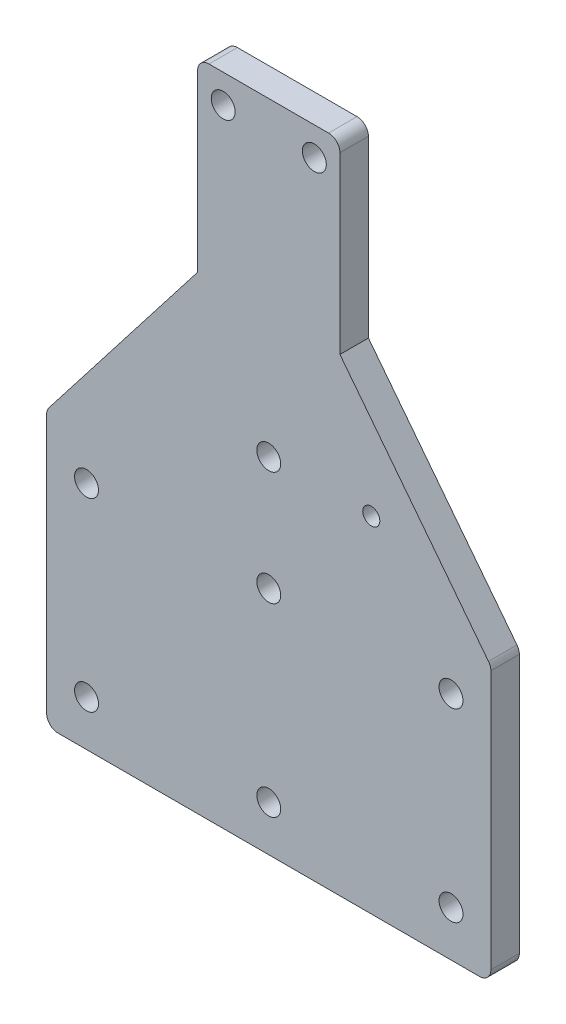
ISO-10303-21;
HEADER;
FILE_DESCRIPTION(('STEP AP214'),'2;1');
FILE_NAME('part.step','',(''),(''),'','','');
FILE_SCHEMA(('AUTOMOTIVE_DESIGN { 1 0 10303 214 1 1 1 1 }'));
ENDSEC;
DATA;
#1=APPLICATION_CONTEXT('core data for automotive mechanical design processes');
#2=APPLICATION_PROTOCOL_DEFINITION('international standard','automotive_design',2000,#1);
#3=PRODUCT_CONTEXT('',#1,'mechanical');
#4=PRODUCT('Part','Part','',(#3));
#5=PRODUCT_RELATED_PRODUCT_CATEGORY('part','',(#4));
#6=PRODUCT_DEFINITION_FORMATION('','',#4);
#7=PRODUCT_DEFINITION_CONTEXT('part definition',#1,'design');
#8=PRODUCT_DEFINITION('design','',#6,#7);
#9=PRODUCT_DEFINITION_SHAPE('','',#8);
#10=(LENGTH_UNIT() NAMED_UNIT(*) SI_UNIT(.MILLI.,.METRE.));
#11=(NAMED_UNIT(*) PLANE_ANGLE_UNIT() SI_UNIT($,.RADIAN.));
#12=(NAMED_UNIT(*) SI_UNIT($,.STERADIAN.) SOLID_ANGLE_UNIT());
#13=UNCERTAINTY_MEASURE_WITH_UNIT(LENGTH_MEASURE(1.E-05),#10,'distance_accuracy_value','');
#14=(GEOMETRIC_REPRESENTATION_CONTEXT(3) GLOBAL_UNCERTAINTY_ASSIGNED_CONTEXT((#13)) GLOBAL_UNIT_ASSIGNED_CONTEXT((#10,
#11,#12)) REPRESENTATION_CONTEXT('',''));
#15=CARTESIAN_POINT('',(0.,0.,0.));
#16=DIRECTION('',(0.,0.,1.));
#17=DIRECTION('',(1.,0.,0.));
#18=AXIS2_PLACEMENT_3D('',#15,#16,#17);
#19=CARTESIAN_POINT('',(-39.,100.232788631687,5.));
#20=DIRECTION('',(1.,0.,0.));
#21=DIRECTION('',(0.,1.,0.));
#22=AXIS2_PLACEMENT_3D('',#19,#20,#21);
#23=PLANE('',#22);
#24=DIRECTION('',(0.,-1.,0.));
#25=VECTOR('',#24,1.);
#26=CARTESIAN_POINT('',(-39.,100.232788631687,0.));
#27=LINE('',#26,#25);
#28=CARTESIAN_POINT('',(-39.,99.5481536847553,0.));
#29=VERTEX_POINT('',#28);
#30=CARTESIAN_POINT('',(-39.,54.0749999999989,0.));
#31=VERTEX_POINT('',#30);
#32=EDGE_CURVE('E180',#29,#31,#27,.T.);
#33=ORIENTED_EDGE('',*,*,#32,.T.);
#34=DIRECTION('',(0.,0.,-1.));
#35=VECTOR('',#34,1.);
#36=CARTESIAN_POINT('',(-39.,54.0749999999989,5.));
#37=LINE('',#36,#35);
#38=CARTESIAN_POINT('',(-39.,54.0749999999989,5.));
#39=VERTEX_POINT('',#38);
#40=EDGE_CURVE('E237',#31,#39,#37,.F.);
#41=ORIENTED_EDGE('',*,*,#40,.T.);
#42=DIRECTION('',(0.,-1.,0.));
#43=VECTOR('',#42,1.);
#44=CARTESIAN_POINT('',(-39.,100.232788631687,5.));
#45=LINE('',#44,#43);
#46=CARTESIAN_POINT('',(-39.,99.5481536847553,5.));
#47=VERTEX_POINT('',#46);
#48=EDGE_CURVE('E200',#47,#39,#45,.T.);
#49=ORIENTED_EDGE('',*,*,#48,.F.);
#50=DIRECTION('',(0.,0.,-1.));
#51=VECTOR('',#50,1.);
#52=CARTESIAN_POINT('',(-39.,99.5481536847553,5.));
#53=LINE('',#52,#51);
#54=EDGE_CURVE('E234',#47,#29,#53,.T.);
#55=ORIENTED_EDGE('',*,*,#54,.T.);
#56=EDGE_LOOP('',(#33,#41,#49,#55));
#57=FACE_BOUND('',#56,.T.);
#58=ADVANCED_FACE('F41',(#57),#23,.F.);
#59=CARTESIAN_POINT('',(27.0128557375144,52.0749999999988,5.));
#60=DIRECTION('',(0.,1.,0.));
#61=DIRECTION('',(-1.,0.,0.));
#62=AXIS2_PLACEMENT_3D('',#59,#60,#61);
#63=PLANE('',#62);
#64=DIRECTION('',(1.,0.,0.));
#65=VECTOR('',#64,1.);
#66=CARTESIAN_POINT('',(27.0128557375144,52.0749999999988,0.));
#67=LINE('',#66,#65);
#68=CARTESIAN_POINT('',(-37.,52.0749999999989,0.));
#69=VERTEX_POINT('',#68);
#70=CARTESIAN_POINT('',(37.,52.0749999999988,0.));
#71=VERTEX_POINT('',#70);
#72=EDGE_CURVE('E183',#69,#71,#67,.T.);
#73=ORIENTED_EDGE('',*,*,#72,.T.);
#74=DIRECTION('',(0.,0.,-1.));
#75=VECTOR('',#74,1.);
#76=CARTESIAN_POINT('',(37.,52.0749999999988,5.));
#77=LINE('',#76,#75);
#78=CARTESIAN_POINT('',(37.,52.0749999999988,5.));
#79=VERTEX_POINT('',#78);
#80=EDGE_CURVE('E222',#71,#79,#77,.F.);
#81=ORIENTED_EDGE('',*,*,#80,.T.);
#82=DIRECTION('',(1.,0.,0.));
#83=VECTOR('',#82,1.);
#84=CARTESIAN_POINT('',(-39.,52.0749999999988,5.));
#85=LINE('',#84,#83);
#86=CARTESIAN_POINT('',(-37.,52.0749999999988,5.));
#87=VERTEX_POINT('',#86);
#88=EDGE_CURVE('E275',#87,#79,#85,.T.);
#89=ORIENTED_EDGE('',*,*,#88,.F.);
#90=DIRECTION('',(0.,0.,-1.));
#91=VECTOR('',#90,1.);
#92=CARTESIAN_POINT('',(-37.,52.0749999999989,5.));
#93=LINE('',#92,#91);
#94=EDGE_CURVE('E219',#87,#69,#93,.T.);
#95=ORIENTED_EDGE('',*,*,#94,.T.);
#96=EDGE_LOOP('',(#73,#81,#89,#95));
#97=FACE_BOUND('',#96,.T.);
#98=ADVANCED_FACE('F294',(#97),#63,.F.);
#99=CARTESIAN_POINT('',(39.,100.232788631687,5.));
#100=DIRECTION('',(-1.,0.,0.));
#101=DIRECTION('',(0.,-1.,0.));
#102=AXIS2_PLACEMENT_3D('',#99,#100,#101);
#103=PLANE('',#102);
#104=DIRECTION('',(0.,1.,0.));
#105=VECTOR('',#104,1.);
#106=CARTESIAN_POINT('',(39.,100.232788631687,5.));
#107=LINE('',#106,#105);
#108=CARTESIAN_POINT('',(39.,54.0749999999988,5.));
#109=VERTEX_POINT('',#108);
#110=CARTESIAN_POINT('',(39.,99.5481536847553,5.));
#111=VERTEX_POINT('',#110);
#112=EDGE_CURVE('E156',#109,#111,#107,.T.);
#113=ORIENTED_EDGE('',*,*,#112,.F.);
#114=DIRECTION('',(0.,0.,-1.));
#115=VECTOR('',#114,1.);
#116=CARTESIAN_POINT('',(39.,54.0749999999988,5.));
#117=LINE('',#116,#115);
#118=CARTESIAN_POINT('',(39.,54.0749999999988,0.));
#119=VERTEX_POINT('',#118);
#120=EDGE_CURVE('E204',#109,#119,#117,.T.);
#121=ORIENTED_EDGE('',*,*,#120,.T.);
#122=DIRECTION('',(0.,1.,0.));
#123=VECTOR('',#122,1.);
#124=CARTESIAN_POINT('',(39.,100.232788631687,0.));
#125=LINE('',#124,#123);
#126=CARTESIAN_POINT('',(39.,99.5481536847553,0.));
#127=VERTEX_POINT('',#126);
#128=EDGE_CURVE('E187',#119,#127,#125,.T.);
#129=ORIENTED_EDGE('',*,*,#128,.T.);
#130=DIRECTION('',(0.,0.,-1.));
#131=VECTOR('',#130,1.);
#132=CARTESIAN_POINT('',(39.,99.5481536847553,5.));
#133=LINE('',#132,#131);
#134=EDGE_CURVE('E166',#127,#111,#133,.F.);
#135=ORIENTED_EDGE('',*,*,#134,.T.);
#136=EDGE_LOOP('',(#113,#121,#129,#135));
#137=FACE_BOUND('',#136,.T.);
#138=ADVANCED_FACE('F299',(#137),#103,.F.);
#139=CARTESIAN_POINT('',(12.4999999999999,134.403841263267,5.));
#140=DIRECTION('',(-0.790219801194744,-0.612823519293883,0.));
#141=DIRECTION('',(0.612823519293883,-0.790219801194744,0.));
#142=AXIS2_PLACEMENT_3D('',#139,#140,#141);
#143=PLANE('',#142);
#144=DIRECTION('',(-0.612823519293883,0.790219801194744,0.));
#145=VECTOR('',#144,1.);
#146=CARTESIAN_POINT('',(12.4999999999999,134.403841263267,5.));
#147=LINE('',#146,#145);
#148=CARTESIAN_POINT('',(38.5804396023895,100.773800723343,5.));
#149=VERTEX_POINT('',#148);
#150=CARTESIAN_POINT('',(12.4999999999999,134.403841263267,5.));
#151=VERTEX_POINT('',#150);
#152=EDGE_CURVE('E143',#149,#151,#147,.T.);
#153=ORIENTED_EDGE('',*,*,#152,.F.);
#154=DIRECTION('',(0.,0.,-1.));
#155=VECTOR('',#154,1.);
#156=CARTESIAN_POINT('',(38.5804396023895,100.773800723343,5.));
#157=LINE('',#156,#155);
#158=CARTESIAN_POINT('',(38.5804396023895,100.773800723343,0.));
#159=VERTEX_POINT('',#158);
#160=EDGE_CURVE('E240',#149,#159,#157,.T.);
#161=ORIENTED_EDGE('',*,*,#160,.T.);
#162=DIRECTION('',(-0.612823519293883,0.790219801194744,0.));
#163=VECTOR('',#162,1.);
#164=CARTESIAN_POINT('',(12.4999999999999,134.403841263267,0.));
#165=LINE('',#164,#163);
#166=CARTESIAN_POINT('',(12.4999999999999,134.403841263267,0.));
#167=VERTEX_POINT('',#166);
#168=EDGE_CURVE('E162',#159,#167,#165,.T.);
#169=ORIENTED_EDGE('',*,*,#168,.T.);
#170=DIRECTION('',(0.,0.,-1.));
#171=VECTOR('',#170,1.);
#172=CARTESIAN_POINT('',(12.4999999999999,134.403841263267,5.));
#173=LINE('',#172,#171);
#174=EDGE_CURVE('E159',#151,#167,#173,.T.);
#175=ORIENTED_EDGE('',*,*,#174,.F.);
#176=EDGE_LOOP('',(#153,#161,#169,#175));
#177=FACE_BOUND('',#176,.T.);
#178=ADVANCED_FACE('F160',(#177),#143,.F.);
#179=CARTESIAN_POINT('',(12.4999999999999,167.074999999999,5.));
#180=DIRECTION('',(-1.,0.,0.));
#181=DIRECTION('',(0.,0.,1.));
#182=AXIS2_PLACEMENT_3D('',#179,#180,#181);
#183=PLANE('',#182);
#184=DIRECTION('',(0.,1.,0.));
#185=VECTOR('',#184,1.);
#186=CARTESIAN_POINT('',(12.4999999999999,167.074999999999,0.));
#187=LINE('',#186,#185);
#188=CARTESIAN_POINT('',(12.4999999999999,165.074999999999,0.));
#189=VERTEX_POINT('',#188);
#190=EDGE_CURVE('E191',#167,#189,#187,.T.);
#191=ORIENTED_EDGE('',*,*,#190,.T.);
#192=DIRECTION('',(0.,0.,-1.));
#193=VECTOR('',#192,1.);
#194=CARTESIAN_POINT('',(12.4999999999999,165.074999999999,5.));
#195=LINE('',#194,#193);
#196=CARTESIAN_POINT('',(12.4999999999999,165.074999999999,5.));
#197=VERTEX_POINT('',#196);
#198=EDGE_CURVE('E11',#189,#197,#195,.F.);
#199=ORIENTED_EDGE('',*,*,#198,.T.);
#200=DIRECTION('',(0.,1.,0.));
#201=VECTOR('',#200,1.);
#202=CARTESIAN_POINT('',(12.4999999999999,167.074999999999,5.));
#203=LINE('',#202,#201);
#204=EDGE_CURVE('E148',#151,#197,#203,.T.);
#205=ORIENTED_EDGE('',*,*,#204,.F.);
#206=ORIENTED_EDGE('',*,*,#174,.T.);
#207=EDGE_LOOP('',(#191,#199,#205,#206));
#208=FACE_BOUND('',#207,.T.);
#209=ADVANCED_FACE('F169',(#208),#183,.F.);
#210=CARTESIAN_POINT('',(-12.4999999999999,167.074999999999,5.));
#211=DIRECTION('',(0.,-1.,0.));
#212=DIRECTION('',(0.,0.,-1.));
#213=AXIS2_PLACEMENT_3D('',#210,#211,#212);
#214=PLANE('',#213);
#215=DIRECTION('',(-1.,0.,0.));
#216=VECTOR('',#215,1.);
#217=CARTESIAN_POINT('',(-12.4999999999999,167.074999999999,0.));
#218=LINE('',#217,#216);
#219=CARTESIAN_POINT('',(10.4999999999999,167.074999999999,0.));
#220=VERTEX_POINT('',#219);
#221=CARTESIAN_POINT('',(-10.4999999999999,167.074999999999,0.));
#222=VERTEX_POINT('',#221);
#223=EDGE_CURVE('E193',#220,#222,#218,.T.);
#224=ORIENTED_EDGE('',*,*,#223,.T.);
#225=DIRECTION('',(0.,0.,-1.));
#226=VECTOR('',#225,1.);
#227=CARTESIAN_POINT('',(-10.4999999999999,167.074999999999,5.));
#228=LINE('',#227,#226);
#229=CARTESIAN_POINT('',(-10.4999999999999,167.074999999999,5.));
#230=VERTEX_POINT('',#229);
#231=EDGE_CURVE('E49',#222,#230,#228,.F.);
#232=ORIENTED_EDGE('',*,*,#231,.T.);
#233=DIRECTION('',(-1.,0.,0.));
#234=VECTOR('',#233,1.);
#235=CARTESIAN_POINT('',(-12.4999999999999,167.074999999999,5.));
#236=LINE('',#235,#234);
#237=CARTESIAN_POINT('',(10.4999999999999,167.074999999999,5.));
#238=VERTEX_POINT('',#237);
#239=EDGE_CURVE('E171',#238,#230,#236,.T.);
#240=ORIENTED_EDGE('',*,*,#239,.F.);
#241=DIRECTION('',(0.,0.,-1.));
#242=VECTOR('',#241,1.);
#243=CARTESIAN_POINT('',(10.4999999999999,167.074999999999,5.));
#244=LINE('',#243,#242);
#245=EDGE_CURVE('E245',#238,#220,#244,.T.);
#246=ORIENTED_EDGE('',*,*,#245,.T.);
#247=EDGE_LOOP('',(#224,#232,#240,#246));
#248=FACE_BOUND('',#247,.T.);
#249=ADVANCED_FACE('F250',(#248),#214,.F.);
#250=CARTESIAN_POINT('',(-12.4999999999999,134.403841263267,5.));
#251=DIRECTION('',(1.,0.,0.));
#252=DIRECTION('',(0.,0.,-1.));
#253=AXIS2_PLACEMENT_3D('',#250,#251,#252);
#254=PLANE('',#253);
#255=DIRECTION('',(0.,-1.,0.));
#256=VECTOR('',#255,1.);
#257=CARTESIAN_POINT('',(-12.4999999999999,134.403841263267,5.));
#258=LINE('',#257,#256);
#259=CARTESIAN_POINT('',(-12.4999999999999,165.074999999999,5.));
#260=VERTEX_POINT('',#259);
#261=CARTESIAN_POINT('',(-12.4999999999999,134.403841263267,5.));
#262=VERTEX_POINT('',#261);
#263=EDGE_CURVE('E173',#260,#262,#258,.T.);
#264=ORIENTED_EDGE('',*,*,#263,.F.);
#265=DIRECTION('',(0.,0.,-1.));
#266=VECTOR('',#265,1.);
#267=CARTESIAN_POINT('',(-12.4999999999999,165.074999999999,5.));
#268=LINE('',#267,#266);
#269=CARTESIAN_POINT('',(-12.4999999999999,165.074999999999,0.));
#270=VERTEX_POINT('',#269);
#271=EDGE_CURVE('E242',#260,#270,#268,.T.);
#272=ORIENTED_EDGE('',*,*,#271,.T.);
#273=DIRECTION('',(0.,-1.,0.));
#274=VECTOR('',#273,1.);
#275=CARTESIAN_POINT('',(-12.4999999999999,134.403841263267,0.));
#276=LINE('',#275,#274);
#277=CARTESIAN_POINT('',(-12.4999999999999,134.403841263267,0.));
#278=VERTEX_POINT('',#277);
#279=EDGE_CURVE('E196',#270,#278,#276,.T.);
#280=ORIENTED_EDGE('',*,*,#279,.T.);
#281=DIRECTION('',(0.,0.,-1.));
#282=VECTOR('',#281,1.);
#283=CARTESIAN_POINT('',(-12.4999999999999,134.403841263267,5.));
#284=LINE('',#283,#282);
#285=EDGE_CURVE('E167',#262,#278,#284,.T.);
#286=ORIENTED_EDGE('',*,*,#285,.F.);
#287=EDGE_LOOP('',(#264,#272,#280,#286));
#288=FACE_BOUND('',#287,.T.);
#289=ADVANCED_FACE('F258',(#288),#254,.F.);
#290=CARTESIAN_POINT('',(-39.,100.232788631687,5.));
#291=DIRECTION('',(0.790219801194744,-0.612823519293883,0.));
#292=DIRECTION('',(0.612823519293883,0.790219801194744,0.));
#293=AXIS2_PLACEMENT_3D('',#290,#291,#292);
#294=PLANE('',#293);
#295=DIRECTION('',(-0.612823519293883,-0.790219801194744,0.));
#296=VECTOR('',#295,1.);
#297=CARTESIAN_POINT('',(-39.,100.232788631687,0.));
#298=LINE('',#297,#296);
#299=CARTESIAN_POINT('',(-38.5804396023895,100.773800723343,0.));
#300=VERTEX_POINT('',#299);
#301=EDGE_CURVE('E198',#278,#300,#298,.T.);
#302=ORIENTED_EDGE('',*,*,#301,.T.);
#303=DIRECTION('',(0.,0.,-1.));
#304=VECTOR('',#303,1.);
#305=CARTESIAN_POINT('',(-38.5804396023895,100.773800723343,5.));
#306=LINE('',#305,#304);
#307=CARTESIAN_POINT('',(-38.5804396023895,100.773800723343,5.));
#308=VERTEX_POINT('',#307);
#309=EDGE_CURVE('E56',#300,#308,#306,.F.);
#310=ORIENTED_EDGE('',*,*,#309,.T.);
#311=DIRECTION('',(-0.612823519293883,-0.790219801194744,0.));
#312=VECTOR('',#311,1.);
#313=CARTESIAN_POINT('',(-39.,100.232788631687,5.));
#314=LINE('',#313,#312);
#315=EDGE_CURVE('E178',#262,#308,#314,.T.);
#316=ORIENTED_EDGE('',*,*,#315,.F.);
#317=ORIENTED_EDGE('',*,*,#285,.T.);
#318=EDGE_LOOP('',(#302,#310,#316,#317));
#319=FACE_BOUND('',#318,.T.);
#320=ADVANCED_FACE('F265',(#319),#294,.F.);
#321=CARTESIAN_POINT('',(0.,0.,5.));
#322=DIRECTION('',(0.,0.,1.));
#323=DIRECTION('',(1.,0.,0.));
#324=AXIS2_PLACEMENT_3D('',#321,#322,#323);
#325=PLANE('',#324);
#326=CARTESIAN_POINT('',(32.,60.0749999999988,5.));
#327=DIRECTION('',(0.,0.,-1.));
#328=DIRECTION('',(-1.,0.,0.));
#329=AXIS2_PLACEMENT_3D('',#326,#327,#328);
#330=CIRCLE('',#329,2.1);
#331=CARTESIAN_POINT('',(29.9,60.0749999999988,5.));
#332=VERTEX_POINT('',#331);
#333=EDGE_CURVE('E585',#332,#332,#330,.T.);
#334=ORIENTED_EDGE('',*,*,#333,.T.);
#335=EDGE_LOOP('',(#334));
#336=FACE_BOUND('',#335,.T.);
#337=CARTESIAN_POINT('',(-32.,60.0749999999988,5.));
#338=DIRECTION('',(0.,0.,-1.));
#339=DIRECTION('',(-1.,0.,0.));
#340=AXIS2_PLACEMENT_3D('',#337,#338,#339);
#341=CIRCLE('',#340,2.1);
#342=CARTESIAN_POINT('',(-34.1,60.0749999999988,5.));
#343=VERTEX_POINT('',#342);
#344=EDGE_CURVE('E589',#343,#343,#341,.T.);
#345=ORIENTED_EDGE('',*,*,#344,.T.);
#346=EDGE_LOOP('',(#345));
#347=FACE_BOUND('',#346,.T.);
#348=CARTESIAN_POINT('',(0.,60.0749999999988,5.));
#349=DIRECTION('',(0.,0.,-1.));
#350=DIRECTION('',(-1.,0.,0.));
#351=AXIS2_PLACEMENT_3D('',#348,#349,#350);
#352=CIRCLE('',#351,2.1);
#353=CARTESIAN_POINT('',(-2.1,60.0749999999988,5.));
#354=VERTEX_POINT('',#353);
#355=EDGE_CURVE('E593',#354,#354,#352,.T.);
#356=ORIENTED_EDGE('',*,*,#355,.T.);
#357=EDGE_LOOP('',(#356));
#358=FACE_BOUND('',#357,.T.);
#359=CARTESIAN_POINT('',(0.,112.574999999999,5.));
#360=DIRECTION('',(0.,0.,-1.));
#361=DIRECTION('',(-1.,0.,0.));
#362=AXIS2_PLACEMENT_3D('',#359,#360,#361);
#363=CIRCLE('',#362,2.10000000000001);
#364=CARTESIAN_POINT('',(-2.10000000000001,112.574999999999,5.));
#365=VERTEX_POINT('',#364);
#366=EDGE_CURVE('E597',#365,#365,#363,.T.);
#367=ORIENTED_EDGE('',*,*,#366,.T.);
#368=EDGE_LOOP('',(#367));
#369=FACE_BOUND('',#368,.T.);
#370=CARTESIAN_POINT('',(0.,92.5749999999988,5.));
#371=DIRECTION('',(0.,0.,-1.));
#372=DIRECTION('',(-1.,0.,0.));
#373=AXIS2_PLACEMENT_3D('',#370,#371,#372);
#374=CIRCLE('',#373,2.10000000000001);
#375=CARTESIAN_POINT('',(-2.10000000000001,92.5749999999988,5.));
#376=VERTEX_POINT('',#375);
#377=EDGE_CURVE('E601',#376,#376,#374,.T.);
#378=ORIENTED_EDGE('',*,*,#377,.T.);
#379=EDGE_LOOP('',(#378));
#380=FACE_BOUND('',#379,.T.);
#381=CARTESIAN_POINT('',(32.,92.5749999999989,5.));
#382=DIRECTION('',(0.,0.,-1.));
#383=DIRECTION('',(-1.,0.,0.));
#384=AXIS2_PLACEMENT_3D('',#381,#382,#383);
#385=CIRCLE('',#384,2.1);
#386=CARTESIAN_POINT('',(29.9,92.5749999999989,5.));
#387=VERTEX_POINT('',#386);
#388=EDGE_CURVE('E184',#387,#387,#385,.T.);
#389=ORIENTED_EDGE('',*,*,#388,.T.);
#390=EDGE_LOOP('',(#389));
#391=FACE_BOUND('',#390,.T.);
#392=CARTESIAN_POINT('',(-32.,92.5749999999988,5.));
#393=DIRECTION('',(0.,0.,-1.));
#394=DIRECTION('',(-1.,0.,0.));
#395=AXIS2_PLACEMENT_3D('',#392,#393,#394);
#396=CIRCLE('',#395,2.1);
#397=CARTESIAN_POINT('',(-34.1,92.5749999999988,5.));
#398=VERTEX_POINT('',#397);
#399=EDGE_CURVE('E608',#398,#398,#396,.T.);
#400=ORIENTED_EDGE('',*,*,#399,.T.);
#401=EDGE_LOOP('',(#400));
#402=FACE_BOUND('',#401,.T.);
#403=CARTESIAN_POINT('',(-8.00000000000004,162.074999999999,5.));
#404=DIRECTION('',(0.,0.,-1.));
#405=DIRECTION('',(-1.,0.,0.));
#406=AXIS2_PLACEMENT_3D('',#403,#404,#405);
#407=CIRCLE('',#406,2.09999999999998);
#408=CARTESIAN_POINT('',(-10.1,162.074999999999,5.));
#409=VERTEX_POINT('',#408);
#410=EDGE_CURVE('E612',#409,#409,#407,.T.);
#411=ORIENTED_EDGE('',*,*,#410,.T.);
#412=EDGE_LOOP('',(#411));
#413=FACE_BOUND('',#412,.T.);
#414=CARTESIAN_POINT('',(7.99999999999996,162.074999999999,5.));
#415=DIRECTION('',(0.,0.,-1.));
#416=DIRECTION('',(-1.,0.,0.));
#417=AXIS2_PLACEMENT_3D('',#414,#415,#416);
#418=CIRCLE('',#417,2.09999999999998);
#419=CARTESIAN_POINT('',(5.89999999999998,162.074999999999,5.));
#420=VERTEX_POINT('',#419);
#421=EDGE_CURVE('E616',#420,#420,#418,.T.);
#422=ORIENTED_EDGE('',*,*,#421,.T.);
#423=EDGE_LOOP('',(#422));
#424=FACE_BOUND('',#423,.T.);
#425=CARTESIAN_POINT('',(18.,112.574999999999,5.));
#426=DIRECTION('',(0.,0.,-1.));
#427=DIRECTION('',(-1.,0.,0.));
#428=AXIS2_PLACEMENT_3D('',#425,#426,#427);
#429=CIRCLE('',#428,1.5);
#430=CARTESIAN_POINT('',(16.5,112.574999999999,5.));
#431=VERTEX_POINT('',#430);
#432=EDGE_CURVE('E279',#431,#431,#429,.T.);
#433=ORIENTED_EDGE('',*,*,#432,.T.);
#434=EDGE_LOOP('',(#433));
#435=FACE_BOUND('',#434,.T.);
#436=ORIENTED_EDGE('',*,*,#88,.T.);
#437=CARTESIAN_POINT('',(37.,54.0749999999988,5.));
#438=DIRECTION('',(0.,0.,1.));
#439=DIRECTION('',(1.,0.,0.));
#440=AXIS2_PLACEMENT_3D('',#437,#438,#439);
#441=CIRCLE('',#440,2.);
#442=EDGE_CURVE('E232',#79,#109,#441,.T.);
#443=ORIENTED_EDGE('',*,*,#442,.T.);
#444=ORIENTED_EDGE('',*,*,#112,.T.);
#445=CARTESIAN_POINT('',(37.,99.5481536847553,5.));
#446=DIRECTION('',(0.,0.,1.));
#447=DIRECTION('',(1.,0.,0.));
#448=AXIS2_PLACEMENT_3D('',#445,#446,#447);
#449=CIRCLE('',#448,2.);
#450=EDGE_CURVE('E152',#111,#149,#449,.T.);
#451=ORIENTED_EDGE('',*,*,#450,.T.);
#452=ORIENTED_EDGE('',*,*,#152,.T.);
#453=ORIENTED_EDGE('',*,*,#204,.T.);
#454=CARTESIAN_POINT('',(10.4999999999999,165.074999999999,5.));
#455=DIRECTION('',(0.,0.,1.));
#456=DIRECTION('',(1.,0.,0.));
#457=AXIS2_PLACEMENT_3D('',#454,#455,#456);
#458=CIRCLE('',#457,2.);
#459=EDGE_CURVE('E224',#197,#238,#458,.T.);
#460=ORIENTED_EDGE('',*,*,#459,.T.);
#461=ORIENTED_EDGE('',*,*,#239,.T.);
#462=CARTESIAN_POINT('',(-10.4999999999999,165.074999999999,5.));
#463=DIRECTION('',(0.,0.,1.));
#464=DIRECTION('',(1.,0.,0.));
#465=AXIS2_PLACEMENT_3D('',#462,#463,#464);
#466=CIRCLE('',#465,2.);
#467=EDGE_CURVE('E64',#230,#260,#466,.T.);
#468=ORIENTED_EDGE('',*,*,#467,.T.);
#469=ORIENTED_EDGE('',*,*,#263,.T.);
#470=ORIENTED_EDGE('',*,*,#315,.T.);
#471=CARTESIAN_POINT('',(-37.,99.5481536847553,5.));
#472=DIRECTION('',(0.,0.,1.));
#473=DIRECTION('',(1.,0.,0.));
#474=AXIS2_PLACEMENT_3D('',#471,#472,#473);
#475=CIRCLE('',#474,2.);
#476=EDGE_CURVE('E228',#308,#47,#475,.T.);
#477=ORIENTED_EDGE('',*,*,#476,.T.);
#478=ORIENTED_EDGE('',*,*,#48,.T.);
#479=CARTESIAN_POINT('',(-37.,54.0749999999989,5.));
#480=DIRECTION('',(0.,0.,1.));
#481=DIRECTION('',(1.,0.,0.));
#482=AXIS2_PLACEMENT_3D('',#479,#480,#481);
#483=CIRCLE('',#482,2.);
#484=EDGE_CURVE('E230',#39,#87,#483,.T.);
#485=ORIENTED_EDGE('',*,*,#484,.T.);
#486=EDGE_LOOP('',(#436,#443,#444,#451,#452,#453,#460,#461,#468,#469,#470,#477,#478,#485));
#487=FACE_BOUND('',#486,.T.);
#488=ADVANCED_FACE('F146',(#336,#347,#358,#369,#380,#391,#402,#413,#424,#435,#487),#325,.T.);
#489=CARTESIAN_POINT('',(0.,0.,0.));
#490=DIRECTION('',(0.,0.,1.));
#491=DIRECTION('',(1.,0.,0.));
#492=AXIS2_PLACEMENT_3D('',#489,#490,#491);
#493=PLANE('',#492);
#494=CARTESIAN_POINT('',(32.,60.0749999999988,0.));
#495=DIRECTION('',(0.,0.,-1.));
#496=DIRECTION('',(-1.,0.,0.));
#497=AXIS2_PLACEMENT_3D('',#494,#495,#496);
#498=CIRCLE('',#497,2.1);
#499=CARTESIAN_POINT('',(29.9,60.0749999999988,0.));
#500=VERTEX_POINT('',#499);
#501=EDGE_CURVE('E621',#500,#500,#498,.T.);
#502=ORIENTED_EDGE('',*,*,#501,.F.);
#503=EDGE_LOOP('',(#502));
#504=FACE_BOUND('',#503,.T.);
#505=CARTESIAN_POINT('',(-32.,60.0749999999988,0.));
#506=DIRECTION('',(0.,0.,-1.));
#507=DIRECTION('',(-1.,0.,0.));
#508=AXIS2_PLACEMENT_3D('',#505,#506,#507);
#509=CIRCLE('',#508,2.1);
#510=CARTESIAN_POINT('',(-34.1,60.0749999999988,0.));
#511=VERTEX_POINT('',#510);
#512=EDGE_CURVE('E624',#511,#511,#509,.T.);
#513=ORIENTED_EDGE('',*,*,#512,.F.);
#514=EDGE_LOOP('',(#513));
#515=FACE_BOUND('',#514,.T.);
#516=CARTESIAN_POINT('',(0.,60.0749999999988,0.));
#517=DIRECTION('',(0.,0.,-1.));
#518=DIRECTION('',(-1.,0.,0.));
#519=AXIS2_PLACEMENT_3D('',#516,#517,#518);
#520=CIRCLE('',#519,2.1);
#521=CARTESIAN_POINT('',(-2.1,60.0749999999988,0.));
#522=VERTEX_POINT('',#521);
#523=EDGE_CURVE('E630',#522,#522,#520,.T.);
#524=ORIENTED_EDGE('',*,*,#523,.F.);
#525=EDGE_LOOP('',(#524));
#526=FACE_BOUND('',#525,.T.);
#527=CARTESIAN_POINT('',(0.,112.574999999999,0.));
#528=DIRECTION('',(0.,0.,-1.));
#529=DIRECTION('',(-1.,0.,0.));
#530=AXIS2_PLACEMENT_3D('',#527,#528,#529);
#531=CIRCLE('',#530,2.10000000000001);
#532=CARTESIAN_POINT('',(-2.10000000000001,112.574999999999,0.));
#533=VERTEX_POINT('',#532);
#534=EDGE_CURVE('E634',#533,#533,#531,.T.);
#535=ORIENTED_EDGE('',*,*,#534,.F.);
#536=EDGE_LOOP('',(#535));
#537=FACE_BOUND('',#536,.T.);
#538=CARTESIAN_POINT('',(0.,92.5749999999988,0.));
#539=DIRECTION('',(0.,0.,-1.));
#540=DIRECTION('',(-1.,0.,0.));
#541=AXIS2_PLACEMENT_3D('',#538,#539,#540);
#542=CIRCLE('',#541,2.10000000000001);
#543=CARTESIAN_POINT('',(-2.10000000000001,92.5749999999988,0.));
#544=VERTEX_POINT('',#543);
#545=EDGE_CURVE('E638',#544,#544,#542,.T.);
#546=ORIENTED_EDGE('',*,*,#545,.F.);
#547=EDGE_LOOP('',(#546));
#548=FACE_BOUND('',#547,.T.);
#549=CARTESIAN_POINT('',(32.,92.5749999999989,0.));
#550=DIRECTION('',(0.,0.,-1.));
#551=DIRECTION('',(-1.,0.,0.));
#552=AXIS2_PLACEMENT_3D('',#549,#550,#551);
#553=CIRCLE('',#552,2.1);
#554=CARTESIAN_POINT('',(29.9,92.5749999999989,0.));
#555=VERTEX_POINT('',#554);
#556=EDGE_CURVE('E643',#555,#555,#553,.T.);
#557=ORIENTED_EDGE('',*,*,#556,.F.);
#558=EDGE_LOOP('',(#557));
#559=FACE_BOUND('',#558,.T.);
#560=CARTESIAN_POINT('',(-32.,92.5749999999988,0.));
#561=DIRECTION('',(0.,0.,-1.));
#562=DIRECTION('',(-1.,0.,0.));
#563=AXIS2_PLACEMENT_3D('',#560,#561,#562);
#564=CIRCLE('',#563,2.1);
#565=CARTESIAN_POINT('',(-34.1,92.5749999999988,0.));
#566=VERTEX_POINT('',#565);
#567=EDGE_CURVE('E646',#566,#566,#564,.T.);
#568=ORIENTED_EDGE('',*,*,#567,.F.);
#569=EDGE_LOOP('',(#568));
#570=FACE_BOUND('',#569,.T.);
#571=CARTESIAN_POINT('',(-8.00000000000004,162.074999999999,0.));
#572=DIRECTION('',(0.,0.,-1.));
#573=DIRECTION('',(-1.,0.,0.));
#574=AXIS2_PLACEMENT_3D('',#571,#572,#573);
#575=CIRCLE('',#574,2.09999999999998);
#576=CARTESIAN_POINT('',(-10.1,162.074999999999,0.));
#577=VERTEX_POINT('',#576);
#578=EDGE_CURVE('E650',#577,#577,#575,.T.);
#579=ORIENTED_EDGE('',*,*,#578,.F.);
#580=EDGE_LOOP('',(#579));
#581=FACE_BOUND('',#580,.T.);
#582=CARTESIAN_POINT('',(7.99999999999996,162.074999999999,0.));
#583=DIRECTION('',(0.,0.,-1.));
#584=DIRECTION('',(-1.,0.,0.));
#585=AXIS2_PLACEMENT_3D('',#582,#583,#584);
#586=CIRCLE('',#585,2.09999999999998);
#587=CARTESIAN_POINT('',(5.89999999999998,162.074999999999,0.));
#588=VERTEX_POINT('',#587);
#589=EDGE_CURVE('E654',#588,#588,#586,.T.);
#590=ORIENTED_EDGE('',*,*,#589,.F.);
#591=EDGE_LOOP('',(#590));
#592=FACE_BOUND('',#591,.T.);
#593=CARTESIAN_POINT('',(18.,112.574999999999,0.));
#594=DIRECTION('',(0.,0.,-1.));
#595=DIRECTION('',(-1.,0.,0.));
#596=AXIS2_PLACEMENT_3D('',#593,#594,#595);
#597=CIRCLE('',#596,1.5);
#598=CARTESIAN_POINT('',(16.5,112.574999999999,0.));
#599=VERTEX_POINT('',#598);
#600=EDGE_CURVE('E619',#599,#599,#597,.T.);
#601=ORIENTED_EDGE('',*,*,#600,.F.);
#602=EDGE_LOOP('',(#601));
#603=FACE_BOUND('',#602,.T.);
#604=ORIENTED_EDGE('',*,*,#128,.F.);
#605=CARTESIAN_POINT('',(37.,54.0749999999988,0.));
#606=DIRECTION('',(0.,0.,1.));
#607=DIRECTION('',(1.,0.,0.));
#608=AXIS2_PLACEMENT_3D('',#605,#606,#607);
#609=CIRCLE('',#608,2.);
#610=EDGE_CURVE('E217',#119,#71,#609,.F.);
#611=ORIENTED_EDGE('',*,*,#610,.T.);
#612=ORIENTED_EDGE('',*,*,#72,.F.);
#613=CARTESIAN_POINT('',(-37.,54.0749999999989,0.));
#614=DIRECTION('',(0.,0.,1.));
#615=DIRECTION('',(1.,0.,0.));
#616=AXIS2_PLACEMENT_3D('',#613,#614,#615);
#617=CIRCLE('',#616,2.);
#618=EDGE_CURVE('E215',#69,#31,#617,.F.);
#619=ORIENTED_EDGE('',*,*,#618,.T.);
#620=ORIENTED_EDGE('',*,*,#32,.F.);
#621=CARTESIAN_POINT('',(-37.,99.5481536847553,0.));
#622=DIRECTION('',(0.,0.,1.));
#623=DIRECTION('',(1.,0.,0.));
#624=AXIS2_PLACEMENT_3D('',#621,#622,#623);
#625=CIRCLE('',#624,2.);
#626=EDGE_CURVE('E213',#29,#300,#625,.F.);
#627=ORIENTED_EDGE('',*,*,#626,.T.);
#628=ORIENTED_EDGE('',*,*,#301,.F.);
#629=ORIENTED_EDGE('',*,*,#279,.F.);
#630=CARTESIAN_POINT('',(-10.4999999999999,165.074999999999,0.));
#631=DIRECTION('',(0.,0.,1.));
#632=DIRECTION('',(1.,0.,0.));
#633=AXIS2_PLACEMENT_3D('',#630,#631,#632);
#634=CIRCLE('',#633,2.);
#635=EDGE_CURVE('E209',#270,#222,#634,.F.);
#636=ORIENTED_EDGE('',*,*,#635,.T.);
#637=ORIENTED_EDGE('',*,*,#223,.F.);
#638=CARTESIAN_POINT('',(10.4999999999999,165.074999999999,0.));
#639=DIRECTION('',(0.,0.,1.));
#640=DIRECTION('',(1.,0.,0.));
#641=AXIS2_PLACEMENT_3D('',#638,#639,#640);
#642=CIRCLE('',#641,2.);
#643=EDGE_CURVE('E207',#220,#189,#642,.F.);
#644=ORIENTED_EDGE('',*,*,#643,.T.);
#645=ORIENTED_EDGE('',*,*,#190,.F.);
#646=ORIENTED_EDGE('',*,*,#168,.F.);
#647=CARTESIAN_POINT('',(37.,99.5481536847553,0.));
#648=DIRECTION('',(0.,0.,1.));
#649=DIRECTION('',(1.,0.,0.));
#650=AXIS2_PLACEMENT_3D('',#647,#648,#649);
#651=CIRCLE('',#650,2.);
#652=EDGE_CURVE('E211',#159,#127,#651,.F.);
#653=ORIENTED_EDGE('',*,*,#652,.T.);
#654=EDGE_LOOP('',(#604,#611,#612,#619,#620,#627,#628,#629,#636,#637,#644,#645,#646,#653));
#655=FACE_BOUND('',#654,.T.);
#656=ADVANCED_FACE('F263',(#504,#515,#526,#537,#548,#559,#570,#581,#592,#603,#655),#493,.F.);
#657=CARTESIAN_POINT('',(18.,112.574999999999,5.));
#658=DIRECTION('',(0.,0.,-1.));
#659=DIRECTION('',(-1.,0.,0.));
#660=AXIS2_PLACEMENT_3D('',#657,#658,#659);
#661=CYLINDRICAL_SURFACE('',#660,1.5);
#662=ORIENTED_EDGE('',*,*,#432,.F.);
#663=EDGE_LOOP('',(#662));
#664=FACE_BOUND('',#663,.T.);
#665=ORIENTED_EDGE('',*,*,#600,.T.);
#666=EDGE_LOOP('',(#665));
#667=FACE_BOUND('',#666,.T.);
#668=ADVANCED_FACE('F442',(#664,#667),#661,.F.);
#669=CARTESIAN_POINT('',(7.99999999999996,162.074999999999,5.));
#670=DIRECTION('',(0.,0.,-1.));
#671=DIRECTION('',(-1.,0.,0.));
#672=AXIS2_PLACEMENT_3D('',#669,#670,#671);
#673=CYLINDRICAL_SURFACE('',#672,2.09999999999998);
#674=ORIENTED_EDGE('',*,*,#421,.F.);
#675=EDGE_LOOP('',(#674));
#676=FACE_BOUND('',#675,.T.);
#677=ORIENTED_EDGE('',*,*,#589,.T.);
#678=EDGE_LOOP('',(#677));
#679=FACE_BOUND('',#678,.T.);
#680=ADVANCED_FACE('F432',(#676,#679),#673,.F.);
#681=CARTESIAN_POINT('',(-8.00000000000004,162.074999999999,5.));
#682=DIRECTION('',(0.,0.,-1.));
#683=DIRECTION('',(-1.,0.,0.));
#684=AXIS2_PLACEMENT_3D('',#681,#682,#683);
#685=CYLINDRICAL_SURFACE('',#684,2.09999999999998);
#686=ORIENTED_EDGE('',*,*,#410,.F.);
#687=EDGE_LOOP('',(#686));
#688=FACE_BOUND('',#687,.T.);
#689=ORIENTED_EDGE('',*,*,#578,.T.);
#690=EDGE_LOOP('',(#689));
#691=FACE_BOUND('',#690,.T.);
#692=ADVANCED_FACE('F422',(#688,#691),#685,.F.);
#693=CARTESIAN_POINT('',(-32.,92.5749999999988,5.));
#694=DIRECTION('',(0.,0.,-1.));
#695=DIRECTION('',(-1.,0.,0.));
#696=AXIS2_PLACEMENT_3D('',#693,#694,#695);
#697=CYLINDRICAL_SURFACE('',#696,2.1);
#698=ORIENTED_EDGE('',*,*,#399,.F.);
#699=EDGE_LOOP('',(#698));
#700=FACE_BOUND('',#699,.T.);
#701=ORIENTED_EDGE('',*,*,#567,.T.);
#702=EDGE_LOOP('',(#701));
#703=FACE_BOUND('',#702,.T.);
#704=ADVANCED_FACE('F412',(#700,#703),#697,.F.);
#705=CARTESIAN_POINT('',(32.,92.5749999999989,5.));
#706=DIRECTION('',(0.,0.,-1.));
#707=DIRECTION('',(-1.,0.,0.));
#708=AXIS2_PLACEMENT_3D('',#705,#706,#707);
#709=CYLINDRICAL_SURFACE('',#708,2.1);
#710=ORIENTED_EDGE('',*,*,#388,.F.);
#711=EDGE_LOOP('',(#710));
#712=FACE_BOUND('',#711,.T.);
#713=ORIENTED_EDGE('',*,*,#556,.T.);
#714=EDGE_LOOP('',(#713));
#715=FACE_BOUND('',#714,.T.);
#716=ADVANCED_FACE('F402',(#712,#715),#709,.F.);
#717=CARTESIAN_POINT('',(0.,92.5749999999988,5.));
#718=DIRECTION('',(0.,0.,-1.));
#719=DIRECTION('',(-1.,0.,0.));
#720=AXIS2_PLACEMENT_3D('',#717,#718,#719);
#721=CYLINDRICAL_SURFACE('',#720,2.10000000000001);
#722=ORIENTED_EDGE('',*,*,#377,.F.);
#723=EDGE_LOOP('',(#722));
#724=FACE_BOUND('',#723,.T.);
#725=ORIENTED_EDGE('',*,*,#545,.T.);
#726=EDGE_LOOP('',(#725));
#727=FACE_BOUND('',#726,.T.);
#728=ADVANCED_FACE('F392',(#724,#727),#721,.F.);
#729=CARTESIAN_POINT('',(0.,112.574999999999,5.));
#730=DIRECTION('',(0.,0.,-1.));
#731=DIRECTION('',(-1.,0.,0.));
#732=AXIS2_PLACEMENT_3D('',#729,#730,#731);
#733=CYLINDRICAL_SURFACE('',#732,2.10000000000001);
#734=ORIENTED_EDGE('',*,*,#366,.F.);
#735=EDGE_LOOP('',(#734));
#736=FACE_BOUND('',#735,.T.);
#737=ORIENTED_EDGE('',*,*,#534,.T.);
#738=EDGE_LOOP('',(#737));
#739=FACE_BOUND('',#738,.T.);
#740=ADVANCED_FACE('F382',(#736,#739),#733,.F.);
#741=CARTESIAN_POINT('',(0.,60.0749999999988,5.));
#742=DIRECTION('',(0.,0.,-1.));
#743=DIRECTION('',(-1.,0.,0.));
#744=AXIS2_PLACEMENT_3D('',#741,#742,#743);
#745=CYLINDRICAL_SURFACE('',#744,2.1);
#746=ORIENTED_EDGE('',*,*,#355,.F.);
#747=EDGE_LOOP('',(#746));
#748=FACE_BOUND('',#747,.T.);
#749=ORIENTED_EDGE('',*,*,#523,.T.);
#750=EDGE_LOOP('',(#749));
#751=FACE_BOUND('',#750,.T.);
#752=ADVANCED_FACE('F372',(#748,#751),#745,.F.);
#753=CARTESIAN_POINT('',(-32.,60.0749999999988,5.));
#754=DIRECTION('',(0.,0.,-1.));
#755=DIRECTION('',(-1.,0.,0.));
#756=AXIS2_PLACEMENT_3D('',#753,#754,#755);
#757=CYLINDRICAL_SURFACE('',#756,2.1);
#758=ORIENTED_EDGE('',*,*,#344,.F.);
#759=EDGE_LOOP('',(#758));
#760=FACE_BOUND('',#759,.T.);
#761=ORIENTED_EDGE('',*,*,#512,.T.);
#762=EDGE_LOOP('',(#761));
#763=FACE_BOUND('',#762,.T.);
#764=ADVANCED_FACE('F362',(#760,#763),#757,.F.);
#765=CARTESIAN_POINT('',(32.,60.0749999999988,5.));
#766=DIRECTION('',(0.,0.,-1.));
#767=DIRECTION('',(-1.,0.,0.));
#768=AXIS2_PLACEMENT_3D('',#765,#766,#767);
#769=CYLINDRICAL_SURFACE('',#768,2.1);
#770=ORIENTED_EDGE('',*,*,#333,.F.);
#771=EDGE_LOOP('',(#770));
#772=FACE_BOUND('',#771,.T.);
#773=ORIENTED_EDGE('',*,*,#501,.T.);
#774=EDGE_LOOP('',(#773));
#775=FACE_BOUND('',#774,.T.);
#776=ADVANCED_FACE('F308',(#772,#775),#769,.F.);
#777=CARTESIAN_POINT('',(37.,54.0749999999988,5.));
#778=DIRECTION('',(0.,0.,-1.));
#779=DIRECTION('',(-1.,0.,0.));
#780=AXIS2_PLACEMENT_3D('',#777,#778,#779);
#781=CYLINDRICAL_SURFACE('',#780,2.);
#782=ORIENTED_EDGE('',*,*,#442,.F.);
#783=ORIENTED_EDGE('',*,*,#80,.F.);
#784=ORIENTED_EDGE('',*,*,#610,.F.);
#785=ORIENTED_EDGE('',*,*,#120,.F.);
#786=EDGE_LOOP('',(#782,#783,#784,#785));
#787=FACE_BOUND('',#786,.T.);
#788=ADVANCED_FACE('F304',(#787),#781,.T.);
#789=CARTESIAN_POINT('',(-37.,54.0749999999989,5.));
#790=DIRECTION('',(0.,0.,-1.));
#791=DIRECTION('',(-1.,0.,0.));
#792=AXIS2_PLACEMENT_3D('',#789,#790,#791);
#793=CYLINDRICAL_SURFACE('',#792,2.);
#794=ORIENTED_EDGE('',*,*,#484,.F.);
#795=ORIENTED_EDGE('',*,*,#40,.F.);
#796=ORIENTED_EDGE('',*,*,#618,.F.);
#797=ORIENTED_EDGE('',*,*,#94,.F.);
#798=EDGE_LOOP('',(#794,#795,#796,#797));
#799=FACE_BOUND('',#798,.T.);
#800=ADVANCED_FACE('F307',(#799),#793,.T.);
#801=CARTESIAN_POINT('',(-37.,99.5481536847553,5.));
#802=DIRECTION('',(0.,0.,-1.));
#803=DIRECTION('',(-1.,0.,0.));
#804=AXIS2_PLACEMENT_3D('',#801,#802,#803);
#805=CYLINDRICAL_SURFACE('',#804,2.);
#806=ORIENTED_EDGE('',*,*,#476,.F.);
#807=ORIENTED_EDGE('',*,*,#309,.F.);
#808=ORIENTED_EDGE('',*,*,#626,.F.);
#809=ORIENTED_EDGE('',*,*,#54,.F.);
#810=EDGE_LOOP('',(#806,#807,#808,#809));
#811=FACE_BOUND('',#810,.T.);
#812=ADVANCED_FACE('F268',(#811),#805,.T.);
#813=CARTESIAN_POINT('',(37.,99.5481536847553,5.));
#814=DIRECTION('',(0.,0.,-1.));
#815=DIRECTION('',(-1.,0.,0.));
#816=AXIS2_PLACEMENT_3D('',#813,#814,#815);
#817=CYLINDRICAL_SURFACE('',#816,2.);
#818=ORIENTED_EDGE('',*,*,#450,.F.);
#819=ORIENTED_EDGE('',*,*,#134,.F.);
#820=ORIENTED_EDGE('',*,*,#652,.F.);
#821=ORIENTED_EDGE('',*,*,#160,.F.);
#822=EDGE_LOOP('',(#818,#819,#820,#821));
#823=FACE_BOUND('',#822,.T.);
#824=ADVANCED_FACE('F287',(#823),#817,.T.);
#825=CARTESIAN_POINT('',(-10.4999999999999,165.074999999999,5.));
#826=DIRECTION('',(0.,0.,-1.));
#827=DIRECTION('',(-1.,0.,0.));
#828=AXIS2_PLACEMENT_3D('',#825,#826,#827);
#829=CYLINDRICAL_SURFACE('',#828,2.);
#830=ORIENTED_EDGE('',*,*,#467,.F.);
#831=ORIENTED_EDGE('',*,*,#231,.F.);
#832=ORIENTED_EDGE('',*,*,#635,.F.);
#833=ORIENTED_EDGE('',*,*,#271,.F.);
#834=EDGE_LOOP('',(#830,#831,#832,#833));
#835=FACE_BOUND('',#834,.T.);
#836=ADVANCED_FACE('F255',(#835),#829,.T.);
#837=CARTESIAN_POINT('',(10.4999999999999,165.074999999999,5.));
#838=DIRECTION('',(0.,0.,-1.));
#839=DIRECTION('',(-1.,0.,0.));
#840=AXIS2_PLACEMENT_3D('',#837,#838,#839);
#841=CYLINDRICAL_SURFACE('',#840,2.);
#842=ORIENTED_EDGE('',*,*,#459,.F.);
#843=ORIENTED_EDGE('',*,*,#198,.F.);
#844=ORIENTED_EDGE('',*,*,#643,.F.);
#845=ORIENTED_EDGE('',*,*,#245,.F.);
#846=EDGE_LOOP('',(#842,#843,#844,#845));
#847=FACE_BOUND('',#846,.T.);
#848=ADVANCED_FACE('F43',(#847),#841,.T.);
#849=CLOSED_SHELL('',(#58,#98,#138,#178,#209,#249,#289,#320,#488,#656,#668,#680,#692,#704,#716,
#728,#740,#752,#764,#776,#788,#800,#812,#824,#836,#848));
#850=MANIFOLD_SOLID_BREP('B2',#849);
#851=ADVANCED_BREP_SHAPE_REPRESENTATION('',(#18,#850),#14);
#852=SHAPE_DEFINITION_REPRESENTATION(#9,#851);
ENDSEC;
END-ISO-10303-21;
